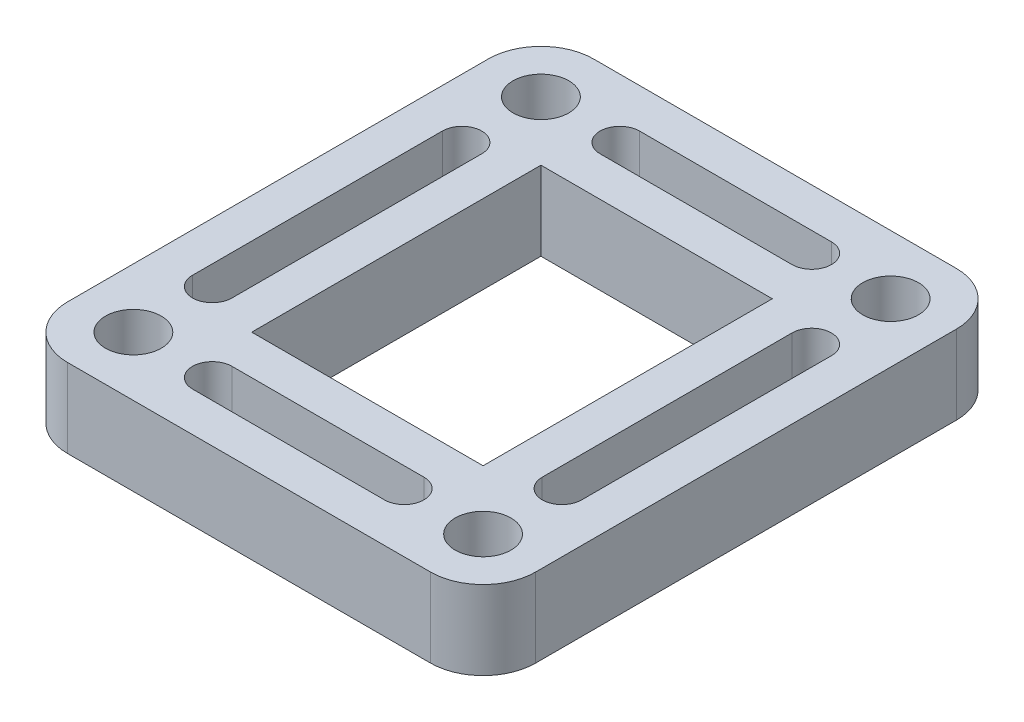
ISO-10303-21;
HEADER;
FILE_DESCRIPTION(('STEP AP214'),'2;1');
FILE_NAME('part.step','',(''),(''),'','','');
FILE_SCHEMA(('AUTOMOTIVE_DESIGN { 1 0 10303 214 1 1 1 1 }'));
ENDSEC;
DATA;
#1=APPLICATION_CONTEXT('core data for automotive mechanical design processes');
#2=APPLICATION_PROTOCOL_DEFINITION('international standard','automotive_design',2000,#1);
#3=PRODUCT_CONTEXT('',#1,'mechanical');
#4=PRODUCT('Part','Part','',(#3));
#5=PRODUCT_RELATED_PRODUCT_CATEGORY('part','',(#4));
#6=PRODUCT_DEFINITION_FORMATION('','',#4);
#7=PRODUCT_DEFINITION_CONTEXT('part definition',#1,'design');
#8=PRODUCT_DEFINITION('design','',#6,#7);
#9=PRODUCT_DEFINITION_SHAPE('','',#8);
#10=(LENGTH_UNIT() NAMED_UNIT(*) SI_UNIT(.MILLI.,.METRE.));
#11=(NAMED_UNIT(*) PLANE_ANGLE_UNIT() SI_UNIT($,.RADIAN.));
#12=(NAMED_UNIT(*) SI_UNIT($,.STERADIAN.) SOLID_ANGLE_UNIT());
#13=UNCERTAINTY_MEASURE_WITH_UNIT(LENGTH_MEASURE(1.E-05),#10,'distance_accuracy_value','');
#14=(GEOMETRIC_REPRESENTATION_CONTEXT(3) GLOBAL_UNCERTAINTY_ASSIGNED_CONTEXT((#13)) GLOBAL_UNIT_ASSIGNED_CONTEXT((#10,
#11,#12)) REPRESENTATION_CONTEXT('',''));
#15=CARTESIAN_POINT('',(0.,0.,0.));
#16=DIRECTION('',(0.,0.,1.));
#17=DIRECTION('',(1.,0.,0.));
#18=AXIS2_PLACEMENT_3D('',#15,#16,#17);
#19=CARTESIAN_POINT('',(-17.526,7.62,20.32));
#20=DIRECTION('',(0.,1.,0.));
#21=DIRECTION('',(0.,0.,1.));
#22=AXIS2_PLACEMENT_3D('',#19,#20,#21);
#23=PLANE('',#22);
#24=CARTESIAN_POINT('',(16.891,7.62,-19.685));
#25=DIRECTION('',(0.,1.,0.));
#26=DIRECTION('',(0.,0.,1.));
#27=AXIS2_PLACEMENT_3D('',#24,#25,#26);
#28=CIRCLE('',#27,2.69407683632075);
#29=CARTESIAN_POINT('',(16.891,7.62,-16.9909231636793));
#30=VERTEX_POINT('',#29);
#31=EDGE_CURVE('E549',#30,#30,#28,.T.);
#32=ORIENTED_EDGE('',*,*,#31,.F.);
#33=EDGE_LOOP('',(#32));
#34=FACE_BOUND('',#33,.T.);
#35=DIRECTION('',(0.,0.,1.));
#36=VECTOR('',#35,1.);
#37=CARTESIAN_POINT('',(-18.796,7.62,-12.065));
#38=LINE('',#37,#36);
#39=CARTESIAN_POINT('',(-18.796,7.62,-12.065));
#40=VERTEX_POINT('',#39);
#41=CARTESIAN_POINT('',(-18.796,7.62,12.065));
#42=VERTEX_POINT('',#41);
#43=EDGE_CURVE('E226',#40,#42,#38,.T.);
#44=ORIENTED_EDGE('',*,*,#43,.F.);
#45=CARTESIAN_POINT('',(-16.891,7.62,-12.065));
#46=DIRECTION('',(0.,1.,0.));
#47=DIRECTION('',(0.,0.,-1.));
#48=AXIS2_PLACEMENT_3D('',#45,#46,#47);
#49=CIRCLE('',#48,1.905);
#50=CARTESIAN_POINT('',(-14.986,7.62,-12.065));
#51=VERTEX_POINT('',#50);
#52=EDGE_CURVE('E218',#51,#40,#49,.T.);
#53=ORIENTED_EDGE('',*,*,#52,.F.);
#54=DIRECTION('',(0.,0.,-1.));
#55=VECTOR('',#54,1.);
#56=CARTESIAN_POINT('',(-14.986,7.62,-12.065));
#57=LINE('',#56,#55);
#58=CARTESIAN_POINT('',(-14.986,7.62,12.065));
#59=VERTEX_POINT('',#58);
#60=EDGE_CURVE('E241',#59,#51,#57,.T.);
#61=ORIENTED_EDGE('',*,*,#60,.F.);
#62=CARTESIAN_POINT('',(-16.891,7.62,12.065));
#63=DIRECTION('',(0.,1.,0.));
#64=DIRECTION('',(0.,0.,-1.));
#65=AXIS2_PLACEMENT_3D('',#62,#63,#64);
#66=CIRCLE('',#65,1.905);
#67=EDGE_CURVE('E239',#42,#59,#66,.T.);
#68=ORIENTED_EDGE('',*,*,#67,.F.);
#69=EDGE_LOOP('',(#44,#53,#61,#68));
#70=FACE_BOUND('',#69,.T.);
#71=CARTESIAN_POINT('',(-16.891,7.62,19.685));
#72=DIRECTION('',(0.,1.,0.));
#73=DIRECTION('',(0.,0.,1.));
#74=AXIS2_PLACEMENT_3D('',#71,#72,#73);
#75=CIRCLE('',#74,2.69407683632075);
#76=CARTESIAN_POINT('',(-16.891,7.62,22.3790768363207));
#77=VERTEX_POINT('',#76);
#78=EDGE_CURVE('E257',#77,#77,#75,.T.);
#79=ORIENTED_EDGE('',*,*,#78,.F.);
#80=EDGE_LOOP('',(#79));
#81=FACE_BOUND('',#80,.T.);
#82=CARTESIAN_POINT('',(-17.526,7.62,20.32));
#83=DIRECTION('',(0.,1.,0.));
#84=DIRECTION('',(0.,0.,1.));
#85=AXIS2_PLACEMENT_3D('',#82,#83,#84);
#86=CIRCLE('',#85,5.08);
#87=CARTESIAN_POINT('',(-22.606,7.62,20.32));
#88=VERTEX_POINT('',#87);
#89=CARTESIAN_POINT('',(-17.526,7.62,25.4));
#90=VERTEX_POINT('',#89);
#91=EDGE_CURVE('E387',#88,#90,#86,.T.);
#92=ORIENTED_EDGE('',*,*,#91,.T.);
#93=DIRECTION('',(1.,0.,0.));
#94=VECTOR('',#93,1.);
#95=CARTESIAN_POINT('',(-17.526,7.62,25.4));
#96=LINE('',#95,#94);
#97=CARTESIAN_POINT('',(17.526,7.62,25.4));
#98=VERTEX_POINT('',#97);
#99=EDGE_CURVE('E390',#90,#98,#96,.T.);
#100=ORIENTED_EDGE('',*,*,#99,.T.);
#101=CARTESIAN_POINT('',(17.526,7.62,20.32));
#102=DIRECTION('',(0.,1.,0.));
#103=DIRECTION('',(0.,0.,1.));
#104=AXIS2_PLACEMENT_3D('',#101,#102,#103);
#105=CIRCLE('',#104,5.08);
#106=CARTESIAN_POINT('',(22.606,7.62,20.32));
#107=VERTEX_POINT('',#106);
#108=EDGE_CURVE('E393',#98,#107,#105,.T.);
#109=ORIENTED_EDGE('',*,*,#108,.T.);
#110=DIRECTION('',(0.,0.,-1.));
#111=VECTOR('',#110,1.);
#112=CARTESIAN_POINT('',(22.606,7.62,20.32));
#113=LINE('',#112,#111);
#114=CARTESIAN_POINT('',(22.606,7.62,-20.32));
#115=VERTEX_POINT('',#114);
#116=EDGE_CURVE('E395',#107,#115,#113,.T.);
#117=ORIENTED_EDGE('',*,*,#116,.T.);
#118=CARTESIAN_POINT('',(17.526,7.62,-20.32));
#119=DIRECTION('',(0.,1.,0.));
#120=DIRECTION('',(0.,0.,1.));
#121=AXIS2_PLACEMENT_3D('',#118,#119,#120);
#122=CIRCLE('',#121,5.08);
#123=CARTESIAN_POINT('',(17.526,7.62,-25.4));
#124=VERTEX_POINT('',#123);
#125=EDGE_CURVE('E397',#115,#124,#122,.T.);
#126=ORIENTED_EDGE('',*,*,#125,.T.);
#127=DIRECTION('',(-1.,0.,0.));
#128=VECTOR('',#127,1.);
#129=CARTESIAN_POINT('',(-17.526,7.62,-25.4));
#130=LINE('',#129,#128);
#131=CARTESIAN_POINT('',(-17.526,7.62,-25.4));
#132=VERTEX_POINT('',#131);
#133=EDGE_CURVE('E399',#124,#132,#130,.T.);
#134=ORIENTED_EDGE('',*,*,#133,.T.);
#135=CARTESIAN_POINT('',(-17.526,7.62,-20.32));
#136=DIRECTION('',(0.,1.,0.));
#137=DIRECTION('',(0.,0.,-1.));
#138=AXIS2_PLACEMENT_3D('',#135,#136,#137);
#139=CIRCLE('',#138,5.08);
#140=CARTESIAN_POINT('',(-22.606,7.62,-20.32));
#141=VERTEX_POINT('',#140);
#142=EDGE_CURVE('E401',#132,#141,#139,.T.);
#143=ORIENTED_EDGE('',*,*,#142,.T.);
#144=DIRECTION('',(0.,0.,1.));
#145=VECTOR('',#144,1.);
#146=CARTESIAN_POINT('',(-22.606,7.62,20.32));
#147=LINE('',#146,#145);
#148=EDGE_CURVE('E403',#141,#88,#147,.T.);
#149=ORIENTED_EDGE('',*,*,#148,.T.);
#150=EDGE_LOOP('',(#92,#100,#109,#117,#126,#134,#143,#149));
#151=FACE_BOUND('',#150,.T.);
#152=DIRECTION('',(-1.,0.,0.));
#153=VECTOR('',#152,1.);
#154=CARTESIAN_POINT('',(-11.176,7.62,-13.97));
#155=LINE('',#154,#153);
#156=CARTESIAN_POINT('',(11.176,7.62,-13.97));
#157=VERTEX_POINT('',#156);
#158=CARTESIAN_POINT('',(-11.176,7.62,-13.97));
#159=VERTEX_POINT('',#158);
#160=EDGE_CURVE('E358',#157,#159,#155,.T.);
#161=ORIENTED_EDGE('',*,*,#160,.F.);
#162=DIRECTION('',(0.,0.,-1.));
#163=VECTOR('',#162,1.);
#164=CARTESIAN_POINT('',(11.176,7.62,13.97));
#165=LINE('',#164,#163);
#166=CARTESIAN_POINT('',(11.176,7.62,13.97));
#167=VERTEX_POINT('',#166);
#168=EDGE_CURVE('E356',#167,#157,#165,.T.);
#169=ORIENTED_EDGE('',*,*,#168,.F.);
#170=DIRECTION('',(1.,0.,0.));
#171=VECTOR('',#170,1.);
#172=CARTESIAN_POINT('',(-11.176,7.62,13.97));
#173=LINE('',#172,#171);
#174=CARTESIAN_POINT('',(-11.176,7.62,13.97));
#175=VERTEX_POINT('',#174);
#176=EDGE_CURVE('E364',#175,#167,#173,.T.);
#177=ORIENTED_EDGE('',*,*,#176,.F.);
#178=DIRECTION('',(0.,0.,1.));
#179=VECTOR('',#178,1.);
#180=CARTESIAN_POINT('',(-11.176,7.62,13.97));
#181=LINE('',#180,#179);
#182=EDGE_CURVE('E361',#159,#175,#181,.T.);
#183=ORIENTED_EDGE('',*,*,#182,.F.);
#184=EDGE_LOOP('',(#161,#169,#177,#183));
#185=FACE_BOUND('',#184,.T.);
#186=DIRECTION('',(0.,0.,1.));
#187=VECTOR('',#186,1.);
#188=CARTESIAN_POINT('',(14.986,7.62,-12.065));
#189=LINE('',#188,#187);
#190=CARTESIAN_POINT('',(14.986,7.62,-12.065));
#191=VERTEX_POINT('',#190);
#192=CARTESIAN_POINT('',(14.986,7.62,12.065));
#193=VERTEX_POINT('',#192);
#194=EDGE_CURVE('E327',#191,#193,#189,.T.);
#195=ORIENTED_EDGE('',*,*,#194,.F.);
#196=CARTESIAN_POINT('',(16.891,7.62,-12.065));
#197=DIRECTION('',(0.,1.,0.));
#198=DIRECTION('',(0.,0.,1.));
#199=AXIS2_PLACEMENT_3D('',#196,#197,#198);
#200=CIRCLE('',#199,1.905);
#201=CARTESIAN_POINT('',(18.796,7.62,-12.065));
#202=VERTEX_POINT('',#201);
#203=EDGE_CURVE('E325',#202,#191,#200,.T.);
#204=ORIENTED_EDGE('',*,*,#203,.F.);
#205=DIRECTION('',(0.,0.,-1.));
#206=VECTOR('',#205,1.);
#207=CARTESIAN_POINT('',(18.796,7.62,-12.065));
#208=LINE('',#207,#206);
#209=CARTESIAN_POINT('',(18.796,7.62,12.065));
#210=VERTEX_POINT('',#209);
#211=EDGE_CURVE('E333',#210,#202,#208,.T.);
#212=ORIENTED_EDGE('',*,*,#211,.F.);
#213=CARTESIAN_POINT('',(16.891,7.62,12.065));
#214=DIRECTION('',(0.,1.,0.));
#215=DIRECTION('',(0.,0.,1.));
#216=AXIS2_PLACEMENT_3D('',#213,#214,#215);
#217=CIRCLE('',#216,1.905);
#218=EDGE_CURVE('E330',#193,#210,#217,.T.);
#219=ORIENTED_EDGE('',*,*,#218,.F.);
#220=EDGE_LOOP('',(#195,#204,#212,#219));
#221=FACE_BOUND('',#220,.T.);
#222=DIRECTION('',(1.,0.,0.));
#223=VECTOR('',#222,1.);
#224=CARTESIAN_POINT('',(-9.271,7.62,21.59));
#225=LINE('',#224,#223);
#226=CARTESIAN_POINT('',(-9.271,7.62,21.59));
#227=VERTEX_POINT('',#226);
#228=CARTESIAN_POINT('',(9.271,7.62,21.59));
#229=VERTEX_POINT('',#228);
#230=EDGE_CURVE('E296',#227,#229,#225,.T.);
#231=ORIENTED_EDGE('',*,*,#230,.F.);
#232=CARTESIAN_POINT('',(-9.271,7.62,19.685));
#233=DIRECTION('',(0.,1.,0.));
#234=DIRECTION('',(0.,0.,1.));
#235=AXIS2_PLACEMENT_3D('',#232,#233,#234);
#236=CIRCLE('',#235,1.905);
#237=CARTESIAN_POINT('',(-9.271,7.62,17.78));
#238=VERTEX_POINT('',#237);
#239=EDGE_CURVE('E294',#238,#227,#236,.T.);
#240=ORIENTED_EDGE('',*,*,#239,.F.);
#241=DIRECTION('',(-1.,0.,0.));
#242=VECTOR('',#241,1.);
#243=CARTESIAN_POINT('',(-9.271,7.62,17.78));
#244=LINE('',#243,#242);
#245=CARTESIAN_POINT('',(9.27099999999999,7.62,17.78));
#246=VERTEX_POINT('',#245);
#247=EDGE_CURVE('E302',#246,#238,#244,.T.);
#248=ORIENTED_EDGE('',*,*,#247,.F.);
#249=CARTESIAN_POINT('',(9.271,7.62,19.685));
#250=DIRECTION('',(0.,1.,0.));
#251=DIRECTION('',(0.,0.,1.));
#252=AXIS2_PLACEMENT_3D('',#249,#250,#251);
#253=CIRCLE('',#252,1.905);
#254=EDGE_CURVE('E299',#229,#246,#253,.T.);
#255=ORIENTED_EDGE('',*,*,#254,.F.);
#256=EDGE_LOOP('',(#231,#240,#248,#255));
#257=FACE_BOUND('',#256,.T.);
#258=DIRECTION('',(1.,0.,0.));
#259=VECTOR('',#258,1.);
#260=CARTESIAN_POINT('',(-9.271,7.62,-17.78));
#261=LINE('',#260,#259);
#262=CARTESIAN_POINT('',(-9.271,7.62,-17.78));
#263=VERTEX_POINT('',#262);
#264=CARTESIAN_POINT('',(9.271,7.62,-17.78));
#265=VERTEX_POINT('',#264);
#266=EDGE_CURVE('E265',#263,#265,#261,.T.);
#267=ORIENTED_EDGE('',*,*,#266,.F.);
#268=CARTESIAN_POINT('',(-9.271,7.62,-19.685));
#269=DIRECTION('',(0.,1.,0.));
#270=DIRECTION('',(0.,0.,-1.));
#271=AXIS2_PLACEMENT_3D('',#268,#269,#270);
#272=CIRCLE('',#271,1.905);
#273=CARTESIAN_POINT('',(-9.271,7.62,-21.59));
#274=VERTEX_POINT('',#273);
#275=EDGE_CURVE('E263',#274,#263,#272,.T.);
#276=ORIENTED_EDGE('',*,*,#275,.F.);
#277=DIRECTION('',(-1.,0.,0.));
#278=VECTOR('',#277,1.);
#279=CARTESIAN_POINT('',(-9.271,7.62,-21.59));
#280=LINE('',#279,#278);
#281=CARTESIAN_POINT('',(9.271,7.62,-21.59));
#282=VERTEX_POINT('',#281);
#283=EDGE_CURVE('E271',#282,#274,#280,.T.);
#284=ORIENTED_EDGE('',*,*,#283,.F.);
#285=CARTESIAN_POINT('',(9.271,7.62,-19.685));
#286=DIRECTION('',(0.,1.,0.));
#287=DIRECTION('',(0.,0.,-1.));
#288=AXIS2_PLACEMENT_3D('',#285,#286,#287);
#289=CIRCLE('',#288,1.905);
#290=EDGE_CURVE('E268',#265,#282,#289,.T.);
#291=ORIENTED_EDGE('',*,*,#290,.F.);
#292=EDGE_LOOP('',(#267,#276,#284,#291));
#293=FACE_BOUND('',#292,.T.);
#294=CARTESIAN_POINT('',(16.891,7.62,19.685));
#295=DIRECTION('',(0.,1.,0.));
#296=DIRECTION('',(0.,0.,-1.));
#297=AXIS2_PLACEMENT_3D('',#294,#295,#296);
#298=CIRCLE('',#297,2.69407683632075);
#299=CARTESIAN_POINT('',(16.891,7.62,16.9909231636793));
#300=VERTEX_POINT('',#299);
#301=EDGE_CURVE('E247',#300,#300,#298,.T.);
#302=ORIENTED_EDGE('',*,*,#301,.F.);
#303=EDGE_LOOP('',(#302));
#304=FACE_BOUND('',#303,.T.);
#305=CARTESIAN_POINT('',(-16.891,7.62,-19.685));
#306=DIRECTION('',(0.,1.,0.));
#307=DIRECTION('',(0.,0.,-1.));
#308=AXIS2_PLACEMENT_3D('',#305,#306,#307);
#309=CIRCLE('',#308,2.69407683632075);
#310=CARTESIAN_POINT('',(-16.891,7.62,-22.3790768363208));
#311=VERTEX_POINT('',#310);
#312=EDGE_CURVE('E543',#311,#311,#309,.T.);
#313=ORIENTED_EDGE('',*,*,#312,.F.);
#314=EDGE_LOOP('',(#313));
#315=FACE_BOUND('',#314,.T.);
#316=ADVANCED_FACE('F33',(#34,#70,#81,#151,#185,#221,#257,#293,#304,#315),#23,.T.);
#317=CARTESIAN_POINT('',(-17.526,0.,20.32));
#318=DIRECTION('',(0.,1.,0.));
#319=DIRECTION('',(0.,0.,1.));
#320=AXIS2_PLACEMENT_3D('',#317,#318,#319);
#321=PLANE('',#320);
#322=CARTESIAN_POINT('',(-16.891,0.,19.685));
#323=DIRECTION('',(0.,1.,0.));
#324=DIRECTION('',(0.,0.,1.));
#325=AXIS2_PLACEMENT_3D('',#322,#323,#324);
#326=CIRCLE('',#325,2.69407683632075);
#327=CARTESIAN_POINT('',(-16.891,0.,22.3790768363207));
#328=VERTEX_POINT('',#327);
#329=EDGE_CURVE('E234',#328,#328,#326,.T.);
#330=ORIENTED_EDGE('',*,*,#329,.T.);
#331=EDGE_LOOP('',(#330));
#332=FACE_BOUND('',#331,.T.);
#333=CARTESIAN_POINT('',(-9.271,0.,-19.685));
#334=DIRECTION('',(0.,1.,0.));
#335=DIRECTION('',(0.,0.,-1.));
#336=AXIS2_PLACEMENT_3D('',#333,#334,#335);
#337=CIRCLE('',#336,1.905);
#338=CARTESIAN_POINT('',(-9.271,0.,-21.59));
#339=VERTEX_POINT('',#338);
#340=CARTESIAN_POINT('',(-9.271,0.,-17.78));
#341=VERTEX_POINT('',#340);
#342=EDGE_CURVE('E260',#339,#341,#337,.T.);
#343=ORIENTED_EDGE('',*,*,#342,.T.);
#344=DIRECTION('',(1.,0.,0.));
#345=VECTOR('',#344,1.);
#346=CARTESIAN_POINT('',(-9.271,0.,-17.78));
#347=LINE('',#346,#345);
#348=CARTESIAN_POINT('',(9.271,0.,-17.78));
#349=VERTEX_POINT('',#348);
#350=EDGE_CURVE('E276',#341,#349,#347,.T.);
#351=ORIENTED_EDGE('',*,*,#350,.T.);
#352=CARTESIAN_POINT('',(9.271,0.,-19.685));
#353=DIRECTION('',(0.,1.,0.));
#354=DIRECTION('',(0.,0.,-1.));
#355=AXIS2_PLACEMENT_3D('',#352,#353,#354);
#356=CIRCLE('',#355,1.905);
#357=CARTESIAN_POINT('',(9.271,0.,-21.59));
#358=VERTEX_POINT('',#357);
#359=EDGE_CURVE('E279',#349,#358,#356,.T.);
#360=ORIENTED_EDGE('',*,*,#359,.T.);
#361=DIRECTION('',(-1.,0.,0.));
#362=VECTOR('',#361,1.);
#363=CARTESIAN_POINT('',(-9.271,0.,-21.59));
#364=LINE('',#363,#362);
#365=EDGE_CURVE('E266',#358,#339,#364,.T.);
#366=ORIENTED_EDGE('',*,*,#365,.T.);
#367=EDGE_LOOP('',(#343,#351,#360,#366));
#368=FACE_BOUND('',#367,.T.);
#369=CARTESIAN_POINT('',(16.891,0.,-12.065));
#370=DIRECTION('',(0.,1.,0.));
#371=DIRECTION('',(0.,0.,1.));
#372=AXIS2_PLACEMENT_3D('',#369,#370,#371);
#373=CIRCLE('',#372,1.905);
#374=CARTESIAN_POINT('',(18.796,0.,-12.065));
#375=VERTEX_POINT('',#374);
#376=CARTESIAN_POINT('',(14.986,0.,-12.065));
#377=VERTEX_POINT('',#376);
#378=EDGE_CURVE('E324',#375,#377,#373,.T.);
#379=ORIENTED_EDGE('',*,*,#378,.T.);
#380=DIRECTION('',(0.,0.,1.));
#381=VECTOR('',#380,1.);
#382=CARTESIAN_POINT('',(14.986,0.,-12.065));
#383=LINE('',#382,#381);
#384=CARTESIAN_POINT('',(14.986,0.,12.065));
#385=VERTEX_POINT('',#384);
#386=EDGE_CURVE('E338',#377,#385,#383,.T.);
#387=ORIENTED_EDGE('',*,*,#386,.T.);
#388=CARTESIAN_POINT('',(16.891,0.,12.065));
#389=DIRECTION('',(0.,1.,0.));
#390=DIRECTION('',(0.,0.,1.));
#391=AXIS2_PLACEMENT_3D('',#388,#389,#390);
#392=CIRCLE('',#391,1.905);
#393=CARTESIAN_POINT('',(18.796,0.,12.065));
#394=VERTEX_POINT('',#393);
#395=EDGE_CURVE('E341',#385,#394,#392,.T.);
#396=ORIENTED_EDGE('',*,*,#395,.T.);
#397=DIRECTION('',(0.,0.,-1.));
#398=VECTOR('',#397,1.);
#399=CARTESIAN_POINT('',(18.796,0.,-12.065));
#400=LINE('',#399,#398);
#401=EDGE_CURVE('E328',#394,#375,#400,.T.);
#402=ORIENTED_EDGE('',*,*,#401,.T.);
#403=EDGE_LOOP('',(#379,#387,#396,#402));
#404=FACE_BOUND('',#403,.T.);
#405=CARTESIAN_POINT('',(-17.526,0.,20.32));
#406=DIRECTION('',(0.,1.,0.));
#407=DIRECTION('',(0.,0.,1.));
#408=AXIS2_PLACEMENT_3D('',#405,#406,#407);
#409=CIRCLE('',#408,5.08);
#410=CARTESIAN_POINT('',(-22.606,0.,20.32));
#411=VERTEX_POINT('',#410);
#412=CARTESIAN_POINT('',(-17.526,0.,25.4));
#413=VERTEX_POINT('',#412);
#414=EDGE_CURVE('E386',#411,#413,#409,.T.);
#415=ORIENTED_EDGE('',*,*,#414,.F.);
#416=DIRECTION('',(0.,0.,1.));
#417=VECTOR('',#416,1.);
#418=CARTESIAN_POINT('',(-22.606,0.,20.32));
#419=LINE('',#418,#417);
#420=CARTESIAN_POINT('',(-22.606,0.,-20.32));
#421=VERTEX_POINT('',#420);
#422=EDGE_CURVE('E391',#421,#411,#419,.T.);
#423=ORIENTED_EDGE('',*,*,#422,.F.);
#424=CARTESIAN_POINT('',(-17.526,0.,-20.32));
#425=DIRECTION('',(0.,1.,0.));
#426=DIRECTION('',(0.,0.,-1.));
#427=AXIS2_PLACEMENT_3D('',#424,#425,#426);
#428=CIRCLE('',#427,5.08);
#429=CARTESIAN_POINT('',(-17.526,0.,-25.4));
#430=VERTEX_POINT('',#429);
#431=EDGE_CURVE('E418',#430,#421,#428,.T.);
#432=ORIENTED_EDGE('',*,*,#431,.F.);
#433=DIRECTION('',(-1.,0.,0.));
#434=VECTOR('',#433,1.);
#435=CARTESIAN_POINT('',(-17.526,0.,-25.4));
#436=LINE('',#435,#434);
#437=CARTESIAN_POINT('',(17.526,0.,-25.4));
#438=VERTEX_POINT('',#437);
#439=EDGE_CURVE('E416',#438,#430,#436,.T.);
#440=ORIENTED_EDGE('',*,*,#439,.F.);
#441=CARTESIAN_POINT('',(17.526,0.,-20.32));
#442=DIRECTION('',(0.,1.,0.));
#443=DIRECTION('',(0.,0.,1.));
#444=AXIS2_PLACEMENT_3D('',#441,#442,#443);
#445=CIRCLE('',#444,5.08);
#446=CARTESIAN_POINT('',(22.606,0.,-20.32));
#447=VERTEX_POINT('',#446);
#448=EDGE_CURVE('E414',#447,#438,#445,.T.);
#449=ORIENTED_EDGE('',*,*,#448,.F.);
#450=DIRECTION('',(0.,0.,-1.));
#451=VECTOR('',#450,1.);
#452=CARTESIAN_POINT('',(22.606,0.,20.32));
#453=LINE('',#452,#451);
#454=CARTESIAN_POINT('',(22.606,0.,20.32));
#455=VERTEX_POINT('',#454);
#456=EDGE_CURVE('E412',#455,#447,#453,.T.);
#457=ORIENTED_EDGE('',*,*,#456,.F.);
#458=CARTESIAN_POINT('',(17.526,0.,20.32));
#459=DIRECTION('',(0.,1.,0.));
#460=DIRECTION('',(0.,0.,1.));
#461=AXIS2_PLACEMENT_3D('',#458,#459,#460);
#462=CIRCLE('',#461,5.08);
#463=CARTESIAN_POINT('',(17.526,0.,25.4));
#464=VERTEX_POINT('',#463);
#465=EDGE_CURVE('E410',#464,#455,#462,.T.);
#466=ORIENTED_EDGE('',*,*,#465,.F.);
#467=DIRECTION('',(1.,0.,0.));
#468=VECTOR('',#467,1.);
#469=CARTESIAN_POINT('',(-17.526,0.,25.4));
#470=LINE('',#469,#468);
#471=EDGE_CURVE('E408',#413,#464,#470,.T.);
#472=ORIENTED_EDGE('',*,*,#471,.F.);
#473=EDGE_LOOP('',(#415,#423,#432,#440,#449,#457,#466,#472));
#474=FACE_BOUND('',#473,.T.);
#475=DIRECTION('',(0.,0.,-1.));
#476=VECTOR('',#475,1.);
#477=CARTESIAN_POINT('',(11.176,0.,13.97));
#478=LINE('',#477,#476);
#479=CARTESIAN_POINT('',(11.176,0.,13.97));
#480=VERTEX_POINT('',#479);
#481=CARTESIAN_POINT('',(11.176,0.,-13.97));
#482=VERTEX_POINT('',#481);
#483=EDGE_CURVE('E355',#480,#482,#478,.T.);
#484=ORIENTED_EDGE('',*,*,#483,.T.);
#485=DIRECTION('',(-1.,0.,0.));
#486=VECTOR('',#485,1.);
#487=CARTESIAN_POINT('',(-11.176,0.,-13.97));
#488=LINE('',#487,#486);
#489=CARTESIAN_POINT('',(-11.176,0.,-13.97));
#490=VERTEX_POINT('',#489);
#491=EDGE_CURVE('E369',#482,#490,#488,.T.);
#492=ORIENTED_EDGE('',*,*,#491,.T.);
#493=DIRECTION('',(0.,0.,1.));
#494=VECTOR('',#493,1.);
#495=CARTESIAN_POINT('',(-11.176,0.,13.97));
#496=LINE('',#495,#494);
#497=CARTESIAN_POINT('',(-11.176,0.,13.97));
#498=VERTEX_POINT('',#497);
#499=EDGE_CURVE('E372',#490,#498,#496,.T.);
#500=ORIENTED_EDGE('',*,*,#499,.T.);
#501=DIRECTION('',(1.,0.,0.));
#502=VECTOR('',#501,1.);
#503=CARTESIAN_POINT('',(-11.176,0.,13.97));
#504=LINE('',#503,#502);
#505=EDGE_CURVE('E359',#498,#480,#504,.T.);
#506=ORIENTED_EDGE('',*,*,#505,.T.);
#507=EDGE_LOOP('',(#484,#492,#500,#506));
#508=FACE_BOUND('',#507,.T.);
#509=CARTESIAN_POINT('',(-9.271,0.,19.685));
#510=DIRECTION('',(0.,1.,0.));
#511=DIRECTION('',(0.,0.,1.));
#512=AXIS2_PLACEMENT_3D('',#509,#510,#511);
#513=CIRCLE('',#512,1.905);
#514=CARTESIAN_POINT('',(-9.271,0.,17.78));
#515=VERTEX_POINT('',#514);
#516=CARTESIAN_POINT('',(-9.271,0.,21.59));
#517=VERTEX_POINT('',#516);
#518=EDGE_CURVE('E293',#515,#517,#513,.T.);
#519=ORIENTED_EDGE('',*,*,#518,.T.);
#520=DIRECTION('',(1.,0.,0.));
#521=VECTOR('',#520,1.);
#522=CARTESIAN_POINT('',(-9.271,0.,21.59));
#523=LINE('',#522,#521);
#524=CARTESIAN_POINT('',(9.271,0.,21.59));
#525=VERTEX_POINT('',#524);
#526=EDGE_CURVE('E307',#517,#525,#523,.T.);
#527=ORIENTED_EDGE('',*,*,#526,.T.);
#528=CARTESIAN_POINT('',(9.271,0.,19.685));
#529=DIRECTION('',(0.,1.,0.));
#530=DIRECTION('',(0.,0.,1.));
#531=AXIS2_PLACEMENT_3D('',#528,#529,#530);
#532=CIRCLE('',#531,1.905);
#533=CARTESIAN_POINT('',(9.271,0.,17.78));
#534=VERTEX_POINT('',#533);
#535=EDGE_CURVE('E310',#525,#534,#532,.T.);
#536=ORIENTED_EDGE('',*,*,#535,.T.);
#537=DIRECTION('',(-1.,0.,0.));
#538=VECTOR('',#537,1.);
#539=CARTESIAN_POINT('',(-9.271,0.,17.78));
#540=LINE('',#539,#538);
#541=EDGE_CURVE('E297',#534,#515,#540,.T.);
#542=ORIENTED_EDGE('',*,*,#541,.T.);
#543=EDGE_LOOP('',(#519,#527,#536,#542));
#544=FACE_BOUND('',#543,.T.);
#545=CARTESIAN_POINT('',(-16.891,0.,-12.065));
#546=DIRECTION('',(0.,1.,0.));
#547=DIRECTION('',(0.,0.,-1.));
#548=AXIS2_PLACEMENT_3D('',#545,#546,#547);
#549=CIRCLE('',#548,1.905);
#550=CARTESIAN_POINT('',(-14.986,0.,-12.065));
#551=VERTEX_POINT('',#550);
#552=CARTESIAN_POINT('',(-18.796,0.,-12.065));
#553=VERTEX_POINT('',#552);
#554=EDGE_CURVE('E56',#551,#553,#549,.T.);
#555=ORIENTED_EDGE('',*,*,#554,.T.);
#556=DIRECTION('',(0.,0.,1.));
#557=VECTOR('',#556,1.);
#558=CARTESIAN_POINT('',(-18.796,0.,-12.065));
#559=LINE('',#558,#557);
#560=CARTESIAN_POINT('',(-18.796,0.,12.065));
#561=VERTEX_POINT('',#560);
#562=EDGE_CURVE('E233',#553,#561,#559,.T.);
#563=ORIENTED_EDGE('',*,*,#562,.T.);
#564=CARTESIAN_POINT('',(-16.891,0.,12.065));
#565=DIRECTION('',(0.,1.,0.));
#566=DIRECTION('',(0.,0.,-1.));
#567=AXIS2_PLACEMENT_3D('',#564,#565,#566);
#568=CIRCLE('',#567,1.905);
#569=CARTESIAN_POINT('',(-14.986,0.,12.065));
#570=VERTEX_POINT('',#569);
#571=EDGE_CURVE('E249',#561,#570,#568,.T.);
#572=ORIENTED_EDGE('',*,*,#571,.T.);
#573=DIRECTION('',(0.,0.,-1.));
#574=VECTOR('',#573,1.);
#575=CARTESIAN_POINT('',(-14.986,0.,-12.065));
#576=LINE('',#575,#574);
#577=EDGE_CURVE('E227',#570,#551,#576,.T.);
#578=ORIENTED_EDGE('',*,*,#577,.T.);
#579=EDGE_LOOP('',(#555,#563,#572,#578));
#580=FACE_BOUND('',#579,.T.);
#581=CARTESIAN_POINT('',(16.891,0.,19.685));
#582=DIRECTION('',(0.,1.,0.));
#583=DIRECTION('',(0.,0.,-1.));
#584=AXIS2_PLACEMENT_3D('',#581,#582,#583);
#585=CIRCLE('',#584,2.69407683632075);
#586=CARTESIAN_POINT('',(16.891,0.,16.9909231636793));
#587=VERTEX_POINT('',#586);
#588=EDGE_CURVE('E555',#587,#587,#585,.T.);
#589=ORIENTED_EDGE('',*,*,#588,.T.);
#590=EDGE_LOOP('',(#589));
#591=FACE_BOUND('',#590,.T.);
#592=CARTESIAN_POINT('',(16.891,0.,-19.685));
#593=DIRECTION('',(0.,1.,0.));
#594=DIRECTION('',(0.,0.,1.));
#595=AXIS2_PLACEMENT_3D('',#592,#593,#594);
#596=CIRCLE('',#595,2.69407683632075);
#597=CARTESIAN_POINT('',(16.891,0.,-16.9909231636793));
#598=VERTEX_POINT('',#597);
#599=EDGE_CURVE('E545',#598,#598,#596,.T.);
#600=ORIENTED_EDGE('',*,*,#599,.T.);
#601=EDGE_LOOP('',(#600));
#602=FACE_BOUND('',#601,.T.);
#603=CARTESIAN_POINT('',(-16.891,0.,-19.685));
#604=DIRECTION('',(0.,1.,0.));
#605=DIRECTION('',(0.,0.,-1.));
#606=AXIS2_PLACEMENT_3D('',#603,#604,#605);
#607=CIRCLE('',#606,2.69407683632075);
#608=CARTESIAN_POINT('',(-16.891,0.,-22.3790768363208));
#609=VERTEX_POINT('',#608);
#610=EDGE_CURVE('E546',#609,#609,#607,.T.);
#611=ORIENTED_EDGE('',*,*,#610,.T.);
#612=EDGE_LOOP('',(#611));
#613=FACE_BOUND('',#612,.T.);
#614=ADVANCED_FACE('F448',(#332,#368,#404,#474,#508,#544,#580,#591,#602,#613),#321,.F.);
#615=CARTESIAN_POINT('',(-17.526,7.62,20.32));
#616=DIRECTION('',(0.,-1.,0.));
#617=DIRECTION('',(0.,0.,-1.));
#618=AXIS2_PLACEMENT_3D('',#615,#616,#617);
#619=CYLINDRICAL_SURFACE('',#618,5.08);
#620=ORIENTED_EDGE('',*,*,#414,.T.);
#621=DIRECTION('',(0.,-1.,0.));
#622=VECTOR('',#621,1.);
#623=CARTESIAN_POINT('',(-17.526,7.62,25.4));
#624=LINE('',#623,#622);
#625=EDGE_CURVE('E11',#90,#413,#624,.T.);
#626=ORIENTED_EDGE('',*,*,#625,.F.);
#627=ORIENTED_EDGE('',*,*,#91,.F.);
#628=DIRECTION('',(0.,-1.,0.));
#629=VECTOR('',#628,1.);
#630=CARTESIAN_POINT('',(-22.606,7.62,20.32));
#631=LINE('',#630,#629);
#632=EDGE_CURVE('E405',#88,#411,#631,.T.);
#633=ORIENTED_EDGE('',*,*,#632,.T.);
#634=EDGE_LOOP('',(#620,#626,#627,#633));
#635=FACE_BOUND('',#634,.T.);
#636=ADVANCED_FACE('F35',(#635),#619,.T.);
#637=CARTESIAN_POINT('',(-17.526,7.62,25.4));
#638=DIRECTION('',(0.,0.,-1.));
#639=DIRECTION('',(-1.,0.,0.));
#640=AXIS2_PLACEMENT_3D('',#637,#638,#639);
#641=PLANE('',#640);
#642=ORIENTED_EDGE('',*,*,#471,.T.);
#643=DIRECTION('',(0.,-1.,0.));
#644=VECTOR('',#643,1.);
#645=CARTESIAN_POINT('',(17.526,7.62,25.4));
#646=LINE('',#645,#644);
#647=EDGE_CURVE('E41',#98,#464,#646,.T.);
#648=ORIENTED_EDGE('',*,*,#647,.F.);
#649=ORIENTED_EDGE('',*,*,#99,.F.);
#650=ORIENTED_EDGE('',*,*,#625,.T.);
#651=EDGE_LOOP('',(#642,#648,#649,#650));
#652=FACE_BOUND('',#651,.T.);
#653=ADVANCED_FACE('F466',(#652),#641,.F.);
#654=CARTESIAN_POINT('',(17.526,7.62,20.32));
#655=DIRECTION('',(0.,-1.,0.));
#656=DIRECTION('',(0.,0.,-1.));
#657=AXIS2_PLACEMENT_3D('',#654,#655,#656);
#658=CYLINDRICAL_SURFACE('',#657,5.08);
#659=ORIENTED_EDGE('',*,*,#465,.T.);
#660=DIRECTION('',(0.,-1.,0.));
#661=VECTOR('',#660,1.);
#662=CARTESIAN_POINT('',(22.606,7.62,20.32));
#663=LINE('',#662,#661);
#664=EDGE_CURVE('E435',#107,#455,#663,.T.);
#665=ORIENTED_EDGE('',*,*,#664,.F.);
#666=ORIENTED_EDGE('',*,*,#108,.F.);
#667=ORIENTED_EDGE('',*,*,#647,.T.);
#668=EDGE_LOOP('',(#659,#665,#666,#667));
#669=FACE_BOUND('',#668,.T.);
#670=ADVANCED_FACE('F442',(#669),#658,.T.);
#671=CARTESIAN_POINT('',(22.606,7.62,20.32));
#672=DIRECTION('',(-1.,0.,0.));
#673=DIRECTION('',(0.,0.,1.));
#674=AXIS2_PLACEMENT_3D('',#671,#672,#673);
#675=PLANE('',#674);
#676=ORIENTED_EDGE('',*,*,#456,.T.);
#677=DIRECTION('',(0.,-1.,0.));
#678=VECTOR('',#677,1.);
#679=CARTESIAN_POINT('',(22.606,7.62,-20.32));
#680=LINE('',#679,#678);
#681=EDGE_CURVE('E432',#115,#447,#680,.T.);
#682=ORIENTED_EDGE('',*,*,#681,.F.);
#683=ORIENTED_EDGE('',*,*,#116,.F.);
#684=ORIENTED_EDGE('',*,*,#664,.T.);
#685=EDGE_LOOP('',(#676,#682,#683,#684));
#686=FACE_BOUND('',#685,.T.);
#687=ADVANCED_FACE('F454',(#686),#675,.F.);
#688=CARTESIAN_POINT('',(17.526,7.62,-20.32));
#689=DIRECTION('',(0.,-1.,0.));
#690=DIRECTION('',(0.,0.,-1.));
#691=AXIS2_PLACEMENT_3D('',#688,#689,#690);
#692=CYLINDRICAL_SURFACE('',#691,5.08);
#693=ORIENTED_EDGE('',*,*,#448,.T.);
#694=DIRECTION('',(0.,-1.,0.));
#695=VECTOR('',#694,1.);
#696=CARTESIAN_POINT('',(17.526,7.62,-25.4));
#697=LINE('',#696,#695);
#698=EDGE_CURVE('E429',#124,#438,#697,.T.);
#699=ORIENTED_EDGE('',*,*,#698,.F.);
#700=ORIENTED_EDGE('',*,*,#125,.F.);
#701=ORIENTED_EDGE('',*,*,#681,.T.);
#702=EDGE_LOOP('',(#693,#699,#700,#701));
#703=FACE_BOUND('',#702,.T.);
#704=ADVANCED_FACE('F458',(#703),#692,.T.);
#705=CARTESIAN_POINT('',(-17.526,7.62,-25.4));
#706=DIRECTION('',(0.,0.,1.));
#707=DIRECTION('',(1.,0.,0.));
#708=AXIS2_PLACEMENT_3D('',#705,#706,#707);
#709=PLANE('',#708);
#710=ORIENTED_EDGE('',*,*,#439,.T.);
#711=DIRECTION('',(0.,-1.,0.));
#712=VECTOR('',#711,1.);
#713=CARTESIAN_POINT('',(-17.526,7.62,-25.4));
#714=LINE('',#713,#712);
#715=EDGE_CURVE('E426',#132,#430,#714,.T.);
#716=ORIENTED_EDGE('',*,*,#715,.F.);
#717=ORIENTED_EDGE('',*,*,#133,.F.);
#718=ORIENTED_EDGE('',*,*,#698,.T.);
#719=EDGE_LOOP('',(#710,#716,#717,#718));
#720=FACE_BOUND('',#719,.T.);
#721=ADVANCED_FACE('F479',(#720),#709,.F.);
#722=CARTESIAN_POINT('',(-17.526,7.62,-20.32));
#723=DIRECTION('',(0.,-1.,0.));
#724=DIRECTION('',(0.,0.,-1.));
#725=AXIS2_PLACEMENT_3D('',#722,#723,#724);
#726=CYLINDRICAL_SURFACE('',#725,5.08);
#727=ORIENTED_EDGE('',*,*,#431,.T.);
#728=DIRECTION('',(0.,-1.,0.));
#729=VECTOR('',#728,1.);
#730=CARTESIAN_POINT('',(-22.606,7.62,-20.32));
#731=LINE('',#730,#729);
#732=EDGE_CURVE('E423',#141,#421,#731,.T.);
#733=ORIENTED_EDGE('',*,*,#732,.F.);
#734=ORIENTED_EDGE('',*,*,#142,.F.);
#735=ORIENTED_EDGE('',*,*,#715,.T.);
#736=EDGE_LOOP('',(#727,#733,#734,#735));
#737=FACE_BOUND('',#736,.T.);
#738=ADVANCED_FACE('F477',(#737),#726,.T.);
#739=CARTESIAN_POINT('',(-22.606,7.62,20.32));
#740=DIRECTION('',(1.,0.,0.));
#741=DIRECTION('',(0.,0.,-1.));
#742=AXIS2_PLACEMENT_3D('',#739,#740,#741);
#743=PLANE('',#742);
#744=ORIENTED_EDGE('',*,*,#422,.T.);
#745=ORIENTED_EDGE('',*,*,#632,.F.);
#746=ORIENTED_EDGE('',*,*,#148,.F.);
#747=ORIENTED_EDGE('',*,*,#732,.T.);
#748=EDGE_LOOP('',(#744,#745,#746,#747));
#749=FACE_BOUND('',#748,.T.);
#750=ADVANCED_FACE('F472',(#749),#743,.F.);
#751=CARTESIAN_POINT('',(11.176,7.62,13.97));
#752=DIRECTION('',(-1.,0.,0.));
#753=DIRECTION('',(0.,0.,1.));
#754=AXIS2_PLACEMENT_3D('',#751,#752,#753);
#755=PLANE('',#754);
#756=ORIENTED_EDGE('',*,*,#483,.F.);
#757=DIRECTION('',(0.,-1.,0.));
#758=VECTOR('',#757,1.);
#759=CARTESIAN_POINT('',(11.176,7.62,13.97));
#760=LINE('',#759,#758);
#761=EDGE_CURVE('E366',#167,#480,#760,.T.);
#762=ORIENTED_EDGE('',*,*,#761,.F.);
#763=ORIENTED_EDGE('',*,*,#168,.T.);
#764=DIRECTION('',(0.,-1.,0.));
#765=VECTOR('',#764,1.);
#766=CARTESIAN_POINT('',(11.176,7.62,-13.97));
#767=LINE('',#766,#765);
#768=EDGE_CURVE('E383',#157,#482,#767,.T.);
#769=ORIENTED_EDGE('',*,*,#768,.T.);
#770=EDGE_LOOP('',(#756,#762,#763,#769));
#771=FACE_BOUND('',#770,.T.);
#772=ADVANCED_FACE('F498',(#771),#755,.T.);
#773=CARTESIAN_POINT('',(-11.176,7.62,-13.97));
#774=DIRECTION('',(0.,0.,1.));
#775=DIRECTION('',(1.,0.,0.));
#776=AXIS2_PLACEMENT_3D('',#773,#774,#775);
#777=PLANE('',#776);
#778=ORIENTED_EDGE('',*,*,#491,.F.);
#779=ORIENTED_EDGE('',*,*,#768,.F.);
#780=ORIENTED_EDGE('',*,*,#160,.T.);
#781=DIRECTION('',(0.,-1.,0.));
#782=VECTOR('',#781,1.);
#783=CARTESIAN_POINT('',(-11.176,7.62,-13.97));
#784=LINE('',#783,#782);
#785=EDGE_CURVE('E381',#159,#490,#784,.T.);
#786=ORIENTED_EDGE('',*,*,#785,.T.);
#787=EDGE_LOOP('',(#778,#779,#780,#786));
#788=FACE_BOUND('',#787,.T.);
#789=ADVANCED_FACE('F505',(#788),#777,.T.);
#790=CARTESIAN_POINT('',(-11.176,7.62,13.97));
#791=DIRECTION('',(1.,0.,0.));
#792=DIRECTION('',(0.,0.,-1.));
#793=AXIS2_PLACEMENT_3D('',#790,#791,#792);
#794=PLANE('',#793);
#795=ORIENTED_EDGE('',*,*,#499,.F.);
#796=ORIENTED_EDGE('',*,*,#785,.F.);
#797=ORIENTED_EDGE('',*,*,#182,.T.);
#798=DIRECTION('',(0.,-1.,0.));
#799=VECTOR('',#798,1.);
#800=CARTESIAN_POINT('',(-11.176,7.62,13.97));
#801=LINE('',#800,#799);
#802=EDGE_CURVE('E379',#175,#498,#801,.T.);
#803=ORIENTED_EDGE('',*,*,#802,.T.);
#804=EDGE_LOOP('',(#795,#796,#797,#803));
#805=FACE_BOUND('',#804,.T.);
#806=ADVANCED_FACE('F510',(#805),#794,.T.);
#807=CARTESIAN_POINT('',(-11.176,7.62,13.97));
#808=DIRECTION('',(0.,0.,-1.));
#809=DIRECTION('',(-1.,0.,0.));
#810=AXIS2_PLACEMENT_3D('',#807,#808,#809);
#811=PLANE('',#810);
#812=ORIENTED_EDGE('',*,*,#505,.F.);
#813=ORIENTED_EDGE('',*,*,#802,.F.);
#814=ORIENTED_EDGE('',*,*,#176,.T.);
#815=ORIENTED_EDGE('',*,*,#761,.T.);
#816=EDGE_LOOP('',(#812,#813,#814,#815));
#817=FACE_BOUND('',#816,.T.);
#818=ADVANCED_FACE('F517',(#817),#811,.T.);
#819=CARTESIAN_POINT('',(16.891,7.62,-12.065));
#820=DIRECTION('',(0.,-1.,0.));
#821=DIRECTION('',(0.,0.,-1.));
#822=AXIS2_PLACEMENT_3D('',#819,#820,#821);
#823=CYLINDRICAL_SURFACE('',#822,1.905);
#824=ORIENTED_EDGE('',*,*,#378,.F.);
#825=DIRECTION('',(0.,-1.,0.));
#826=VECTOR('',#825,1.);
#827=CARTESIAN_POINT('',(18.796,7.62,-12.065));
#828=LINE('',#827,#826);
#829=EDGE_CURVE('E335',#202,#375,#828,.T.);
#830=ORIENTED_EDGE('',*,*,#829,.F.);
#831=ORIENTED_EDGE('',*,*,#203,.T.);
#832=DIRECTION('',(0.,-1.,0.));
#833=VECTOR('',#832,1.);
#834=CARTESIAN_POINT('',(14.986,7.62,-12.065));
#835=LINE('',#834,#833);
#836=EDGE_CURVE('E352',#191,#377,#835,.T.);
#837=ORIENTED_EDGE('',*,*,#836,.T.);
#838=EDGE_LOOP('',(#824,#830,#831,#837));
#839=FACE_BOUND('',#838,.T.);
#840=ADVANCED_FACE('F633',(#839),#823,.F.);
#841=CARTESIAN_POINT('',(14.986,7.62,-12.065));
#842=DIRECTION('',(1.,0.,0.));
#843=DIRECTION('',(0.,0.,-1.));
#844=AXIS2_PLACEMENT_3D('',#841,#842,#843);
#845=PLANE('',#844);
#846=ORIENTED_EDGE('',*,*,#386,.F.);
#847=ORIENTED_EDGE('',*,*,#836,.F.);
#848=ORIENTED_EDGE('',*,*,#194,.T.);
#849=DIRECTION('',(0.,-1.,0.));
#850=VECTOR('',#849,1.);
#851=CARTESIAN_POINT('',(14.986,7.62,12.065));
#852=LINE('',#851,#850);
#853=EDGE_CURVE('E350',#193,#385,#852,.T.);
#854=ORIENTED_EDGE('',*,*,#853,.T.);
#855=EDGE_LOOP('',(#846,#847,#848,#854));
#856=FACE_BOUND('',#855,.T.);
#857=ADVANCED_FACE('F629',(#856),#845,.T.);
#858=CARTESIAN_POINT('',(16.891,7.62,12.065));
#859=DIRECTION('',(0.,-1.,0.));
#860=DIRECTION('',(0.,0.,-1.));
#861=AXIS2_PLACEMENT_3D('',#858,#859,#860);
#862=CYLINDRICAL_SURFACE('',#861,1.905);
#863=ORIENTED_EDGE('',*,*,#395,.F.);
#864=ORIENTED_EDGE('',*,*,#853,.F.);
#865=ORIENTED_EDGE('',*,*,#218,.T.);
#866=DIRECTION('',(0.,-1.,0.));
#867=VECTOR('',#866,1.);
#868=CARTESIAN_POINT('',(18.796,7.62,12.065));
#869=LINE('',#868,#867);
#870=EDGE_CURVE('E348',#210,#394,#869,.T.);
#871=ORIENTED_EDGE('',*,*,#870,.T.);
#872=EDGE_LOOP('',(#863,#864,#865,#871));
#873=FACE_BOUND('',#872,.T.);
#874=ADVANCED_FACE('F625',(#873),#862,.F.);
#875=CARTESIAN_POINT('',(18.796,7.62,-12.065));
#876=DIRECTION('',(-1.,0.,0.));
#877=DIRECTION('',(0.,0.,1.));
#878=AXIS2_PLACEMENT_3D('',#875,#876,#877);
#879=PLANE('',#878);
#880=ORIENTED_EDGE('',*,*,#401,.F.);
#881=ORIENTED_EDGE('',*,*,#870,.F.);
#882=ORIENTED_EDGE('',*,*,#211,.T.);
#883=ORIENTED_EDGE('',*,*,#829,.T.);
#884=EDGE_LOOP('',(#880,#881,#882,#883));
#885=FACE_BOUND('',#884,.T.);
#886=ADVANCED_FACE('F621',(#885),#879,.T.);
#887=CARTESIAN_POINT('',(-9.271,7.62,19.685));
#888=DIRECTION('',(0.,-1.,0.));
#889=DIRECTION('',(0.,0.,-1.));
#890=AXIS2_PLACEMENT_3D('',#887,#888,#889);
#891=CYLINDRICAL_SURFACE('',#890,1.905);
#892=ORIENTED_EDGE('',*,*,#518,.F.);
#893=DIRECTION('',(0.,-1.,0.));
#894=VECTOR('',#893,1.);
#895=CARTESIAN_POINT('',(-9.271,7.62,17.78));
#896=LINE('',#895,#894);
#897=EDGE_CURVE('E304',#238,#515,#896,.T.);
#898=ORIENTED_EDGE('',*,*,#897,.F.);
#899=ORIENTED_EDGE('',*,*,#239,.T.);
#900=DIRECTION('',(0.,-1.,0.));
#901=VECTOR('',#900,1.);
#902=CARTESIAN_POINT('',(-9.271,7.62,21.59));
#903=LINE('',#902,#901);
#904=EDGE_CURVE('E321',#227,#517,#903,.T.);
#905=ORIENTED_EDGE('',*,*,#904,.T.);
#906=EDGE_LOOP('',(#892,#898,#899,#905));
#907=FACE_BOUND('',#906,.T.);
#908=ADVANCED_FACE('F617',(#907),#891,.F.);
#909=CARTESIAN_POINT('',(-9.271,7.62,21.59));
#910=DIRECTION('',(0.,0.,-1.));
#911=DIRECTION('',(-1.,0.,0.));
#912=AXIS2_PLACEMENT_3D('',#909,#910,#911);
#913=PLANE('',#912);
#914=ORIENTED_EDGE('',*,*,#526,.F.);
#915=ORIENTED_EDGE('',*,*,#904,.F.);
#916=ORIENTED_EDGE('',*,*,#230,.T.);
#917=DIRECTION('',(0.,-1.,0.));
#918=VECTOR('',#917,1.);
#919=CARTESIAN_POINT('',(9.271,7.62,21.59));
#920=LINE('',#919,#918);
#921=EDGE_CURVE('E319',#229,#525,#920,.T.);
#922=ORIENTED_EDGE('',*,*,#921,.T.);
#923=EDGE_LOOP('',(#914,#915,#916,#922));
#924=FACE_BOUND('',#923,.T.);
#925=ADVANCED_FACE('F613',(#924),#913,.T.);
#926=CARTESIAN_POINT('',(9.271,7.62,19.685));
#927=DIRECTION('',(0.,-1.,0.));
#928=DIRECTION('',(0.,0.,-1.));
#929=AXIS2_PLACEMENT_3D('',#926,#927,#928);
#930=CYLINDRICAL_SURFACE('',#929,1.905);
#931=ORIENTED_EDGE('',*,*,#535,.F.);
#932=ORIENTED_EDGE('',*,*,#921,.F.);
#933=ORIENTED_EDGE('',*,*,#254,.T.);
#934=DIRECTION('',(0.,-1.,0.));
#935=VECTOR('',#934,1.);
#936=CARTESIAN_POINT('',(9.271,7.62,17.78));
#937=LINE('',#936,#935);
#938=EDGE_CURVE('E317',#246,#534,#937,.T.);
#939=ORIENTED_EDGE('',*,*,#938,.T.);
#940=EDGE_LOOP('',(#931,#932,#933,#939));
#941=FACE_BOUND('',#940,.T.);
#942=ADVANCED_FACE('F609',(#941),#930,.F.);
#943=CARTESIAN_POINT('',(-9.271,7.62,17.78));
#944=DIRECTION('',(0.,0.,1.));
#945=DIRECTION('',(1.,0.,0.));
#946=AXIS2_PLACEMENT_3D('',#943,#944,#945);
#947=PLANE('',#946);
#948=ORIENTED_EDGE('',*,*,#541,.F.);
#949=ORIENTED_EDGE('',*,*,#938,.F.);
#950=ORIENTED_EDGE('',*,*,#247,.T.);
#951=ORIENTED_EDGE('',*,*,#897,.T.);
#952=EDGE_LOOP('',(#948,#949,#950,#951));
#953=FACE_BOUND('',#952,.T.);
#954=ADVANCED_FACE('F605',(#953),#947,.T.);
#955=CARTESIAN_POINT('',(-9.271,7.62,-19.685));
#956=DIRECTION('',(0.,-1.,0.));
#957=DIRECTION('',(0.,0.,-1.));
#958=AXIS2_PLACEMENT_3D('',#955,#956,#957);
#959=CYLINDRICAL_SURFACE('',#958,1.905);
#960=ORIENTED_EDGE('',*,*,#342,.F.);
#961=DIRECTION('',(0.,-1.,0.));
#962=VECTOR('',#961,1.);
#963=CARTESIAN_POINT('',(-9.271,7.62,-21.59));
#964=LINE('',#963,#962);
#965=EDGE_CURVE('E273',#274,#339,#964,.T.);
#966=ORIENTED_EDGE('',*,*,#965,.F.);
#967=ORIENTED_EDGE('',*,*,#275,.T.);
#968=DIRECTION('',(0.,-1.,0.));
#969=VECTOR('',#968,1.);
#970=CARTESIAN_POINT('',(-9.271,7.62,-17.78));
#971=LINE('',#970,#969);
#972=EDGE_CURVE('E290',#263,#341,#971,.T.);
#973=ORIENTED_EDGE('',*,*,#972,.T.);
#974=EDGE_LOOP('',(#960,#966,#967,#973));
#975=FACE_BOUND('',#974,.T.);
#976=ADVANCED_FACE('F601',(#975),#959,.F.);
#977=CARTESIAN_POINT('',(-9.271,7.62,-17.78));
#978=DIRECTION('',(0.,0.,-1.));
#979=DIRECTION('',(-1.,0.,0.));
#980=AXIS2_PLACEMENT_3D('',#977,#978,#979);
#981=PLANE('',#980);
#982=ORIENTED_EDGE('',*,*,#350,.F.);
#983=ORIENTED_EDGE('',*,*,#972,.F.);
#984=ORIENTED_EDGE('',*,*,#266,.T.);
#985=DIRECTION('',(0.,-1.,0.));
#986=VECTOR('',#985,1.);
#987=CARTESIAN_POINT('',(9.271,7.62,-17.78));
#988=LINE('',#987,#986);
#989=EDGE_CURVE('E288',#265,#349,#988,.T.);
#990=ORIENTED_EDGE('',*,*,#989,.T.);
#991=EDGE_LOOP('',(#982,#983,#984,#990));
#992=FACE_BOUND('',#991,.T.);
#993=ADVANCED_FACE('F597',(#992),#981,.T.);
#994=CARTESIAN_POINT('',(9.271,7.62,-19.685));
#995=DIRECTION('',(0.,-1.,0.));
#996=DIRECTION('',(0.,0.,-1.));
#997=AXIS2_PLACEMENT_3D('',#994,#995,#996);
#998=CYLINDRICAL_SURFACE('',#997,1.905);
#999=ORIENTED_EDGE('',*,*,#359,.F.);
#1000=ORIENTED_EDGE('',*,*,#989,.F.);
#1001=ORIENTED_EDGE('',*,*,#290,.T.);
#1002=DIRECTION('',(0.,-1.,0.));
#1003=VECTOR('',#1002,1.);
#1004=CARTESIAN_POINT('',(9.271,7.62,-21.59));
#1005=LINE('',#1004,#1003);
#1006=EDGE_CURVE('E286',#282,#358,#1005,.T.);
#1007=ORIENTED_EDGE('',*,*,#1006,.T.);
#1008=EDGE_LOOP('',(#999,#1000,#1001,#1007));
#1009=FACE_BOUND('',#1008,.T.);
#1010=ADVANCED_FACE('F593',(#1009),#998,.F.);
#1011=CARTESIAN_POINT('',(-9.271,7.62,-21.59));
#1012=DIRECTION('',(0.,0.,1.));
#1013=DIRECTION('',(1.,0.,0.));
#1014=AXIS2_PLACEMENT_3D('',#1011,#1012,#1013);
#1015=PLANE('',#1014);
#1016=ORIENTED_EDGE('',*,*,#365,.F.);
#1017=ORIENTED_EDGE('',*,*,#1006,.F.);
#1018=ORIENTED_EDGE('',*,*,#283,.T.);
#1019=ORIENTED_EDGE('',*,*,#965,.T.);
#1020=EDGE_LOOP('',(#1016,#1017,#1018,#1019));
#1021=FACE_BOUND('',#1020,.T.);
#1022=ADVANCED_FACE('F589',(#1021),#1015,.T.);
#1023=CARTESIAN_POINT('',(-16.891,7.62,19.685));
#1024=DIRECTION('',(0.,-1.,0.));
#1025=DIRECTION('',(0.,0.,-1.));
#1026=AXIS2_PLACEMENT_3D('',#1023,#1024,#1025);
#1027=CYLINDRICAL_SURFACE('',#1026,2.69407683632075);
#1028=ORIENTED_EDGE('',*,*,#78,.T.);
#1029=EDGE_LOOP('',(#1028));
#1030=FACE_BOUND('',#1029,.T.);
#1031=ORIENTED_EDGE('',*,*,#329,.F.);
#1032=EDGE_LOOP('',(#1031));
#1033=FACE_BOUND('',#1032,.T.);
#1034=ADVANCED_FACE('F586',(#1030,#1033),#1027,.F.);
#1035=CARTESIAN_POINT('',(-16.891,7.62,-12.065));
#1036=DIRECTION('',(0.,-1.,0.));
#1037=DIRECTION('',(0.,0.,-1.));
#1038=AXIS2_PLACEMENT_3D('',#1035,#1036,#1037);
#1039=CYLINDRICAL_SURFACE('',#1038,1.905);
#1040=ORIENTED_EDGE('',*,*,#554,.F.);
#1041=DIRECTION('',(0.,-1.,0.));
#1042=VECTOR('',#1041,1.);
#1043=CARTESIAN_POINT('',(-14.986,7.62,-12.065));
#1044=LINE('',#1043,#1042);
#1045=EDGE_CURVE('E222',#51,#551,#1044,.T.);
#1046=ORIENTED_EDGE('',*,*,#1045,.F.);
#1047=ORIENTED_EDGE('',*,*,#52,.T.);
#1048=DIRECTION('',(0.,-1.,0.));
#1049=VECTOR('',#1048,1.);
#1050=CARTESIAN_POINT('',(-18.796,7.62,-12.065));
#1051=LINE('',#1050,#1049);
#1052=EDGE_CURVE('E221',#40,#553,#1051,.T.);
#1053=ORIENTED_EDGE('',*,*,#1052,.T.);
#1054=EDGE_LOOP('',(#1040,#1046,#1047,#1053));
#1055=FACE_BOUND('',#1054,.T.);
#1056=ADVANCED_FACE('F220',(#1055),#1039,.F.);
#1057=CARTESIAN_POINT('',(-18.796,7.62,-12.065));
#1058=DIRECTION('',(1.,0.,0.));
#1059=DIRECTION('',(0.,0.,-1.));
#1060=AXIS2_PLACEMENT_3D('',#1057,#1058,#1059);
#1061=PLANE('',#1060);
#1062=ORIENTED_EDGE('',*,*,#562,.F.);
#1063=ORIENTED_EDGE('',*,*,#1052,.F.);
#1064=ORIENTED_EDGE('',*,*,#43,.T.);
#1065=DIRECTION('',(0.,-1.,0.));
#1066=VECTOR('',#1065,1.);
#1067=CARTESIAN_POINT('',(-18.796,7.62,12.065));
#1068=LINE('',#1067,#1066);
#1069=EDGE_CURVE('E235',#42,#561,#1068,.T.);
#1070=ORIENTED_EDGE('',*,*,#1069,.T.);
#1071=EDGE_LOOP('',(#1062,#1063,#1064,#1070));
#1072=FACE_BOUND('',#1071,.T.);
#1073=ADVANCED_FACE('F230',(#1072),#1061,.T.);
#1074=CARTESIAN_POINT('',(-16.891,7.62,12.065));
#1075=DIRECTION('',(0.,-1.,0.));
#1076=DIRECTION('',(0.,0.,-1.));
#1077=AXIS2_PLACEMENT_3D('',#1074,#1075,#1076);
#1078=CYLINDRICAL_SURFACE('',#1077,1.905);
#1079=ORIENTED_EDGE('',*,*,#571,.F.);
#1080=ORIENTED_EDGE('',*,*,#1069,.F.);
#1081=ORIENTED_EDGE('',*,*,#67,.T.);
#1082=DIRECTION('',(0.,-1.,0.));
#1083=VECTOR('',#1082,1.);
#1084=CARTESIAN_POINT('',(-14.986,7.62,12.065));
#1085=LINE('',#1084,#1083);
#1086=EDGE_CURVE('E48',#59,#570,#1085,.T.);
#1087=ORIENTED_EDGE('',*,*,#1086,.T.);
#1088=EDGE_LOOP('',(#1079,#1080,#1081,#1087));
#1089=FACE_BOUND('',#1088,.T.);
#1090=ADVANCED_FACE('F575',(#1089),#1078,.F.);
#1091=CARTESIAN_POINT('',(-14.986,7.62,-12.065));
#1092=DIRECTION('',(-1.,0.,0.));
#1093=DIRECTION('',(0.,0.,1.));
#1094=AXIS2_PLACEMENT_3D('',#1091,#1092,#1093);
#1095=PLANE('',#1094);
#1096=ORIENTED_EDGE('',*,*,#577,.F.);
#1097=ORIENTED_EDGE('',*,*,#1086,.F.);
#1098=ORIENTED_EDGE('',*,*,#60,.T.);
#1099=ORIENTED_EDGE('',*,*,#1045,.T.);
#1100=EDGE_LOOP('',(#1096,#1097,#1098,#1099));
#1101=FACE_BOUND('',#1100,.T.);
#1102=ADVANCED_FACE('F565',(#1101),#1095,.T.);
#1103=CARTESIAN_POINT('',(16.891,7.62,19.685));
#1104=DIRECTION('',(0.,-1.,0.));
#1105=DIRECTION('',(0.,0.,-1.));
#1106=AXIS2_PLACEMENT_3D('',#1103,#1104,#1105);
#1107=CYLINDRICAL_SURFACE('',#1106,2.69407683632075);
#1108=ORIENTED_EDGE('',*,*,#301,.T.);
#1109=EDGE_LOOP('',(#1108));
#1110=FACE_BOUND('',#1109,.T.);
#1111=ORIENTED_EDGE('',*,*,#588,.F.);
#1112=EDGE_LOOP('',(#1111));
#1113=FACE_BOUND('',#1112,.T.);
#1114=ADVANCED_FACE('F562',(#1110,#1113),#1107,.F.);
#1115=CARTESIAN_POINT('',(16.891,7.62,-19.685));
#1116=DIRECTION('',(0.,-1.,0.));
#1117=DIRECTION('',(0.,0.,-1.));
#1118=AXIS2_PLACEMENT_3D('',#1115,#1116,#1117);
#1119=CYLINDRICAL_SURFACE('',#1118,2.69407683632075);
#1120=ORIENTED_EDGE('',*,*,#31,.T.);
#1121=EDGE_LOOP('',(#1120));
#1122=FACE_BOUND('',#1121,.T.);
#1123=ORIENTED_EDGE('',*,*,#599,.F.);
#1124=EDGE_LOOP('',(#1123));
#1125=FACE_BOUND('',#1124,.T.);
#1126=ADVANCED_FACE('F564',(#1122,#1125),#1119,.F.);
#1127=CARTESIAN_POINT('',(-16.891,7.62,-19.685));
#1128=DIRECTION('',(0.,-1.,0.));
#1129=DIRECTION('',(0.,0.,-1.));
#1130=AXIS2_PLACEMENT_3D('',#1127,#1128,#1129);
#1131=CYLINDRICAL_SURFACE('',#1130,2.69407683632075);
#1132=ORIENTED_EDGE('',*,*,#312,.T.);
#1133=EDGE_LOOP('',(#1132));
#1134=FACE_BOUND('',#1133,.T.);
#1135=ORIENTED_EDGE('',*,*,#610,.F.);
#1136=EDGE_LOOP('',(#1135));
#1137=FACE_BOUND('',#1136,.T.);
#1138=ADVANCED_FACE('F572',(#1134,#1137),#1131,.F.);
#1139=CLOSED_SHELL('',(#316,#614,#636,#653,#670,#687,#704,#721,#738,#750,#772,#789,#806,#818,
#840,#857,#874,#886,#908,#925,#942,#954,#976,#993,#1010,#1022,#1034,#1056,#1073,#1090,#1102,
#1114,#1126,#1138));
#1140=MANIFOLD_SOLID_BREP('B2',#1139);
#1141=ADVANCED_BREP_SHAPE_REPRESENTATION('',(#18,#1140),#14);
#1142=SHAPE_DEFINITION_REPRESENTATION(#9,#1141);
ENDSEC;
END-ISO-10303-21;
